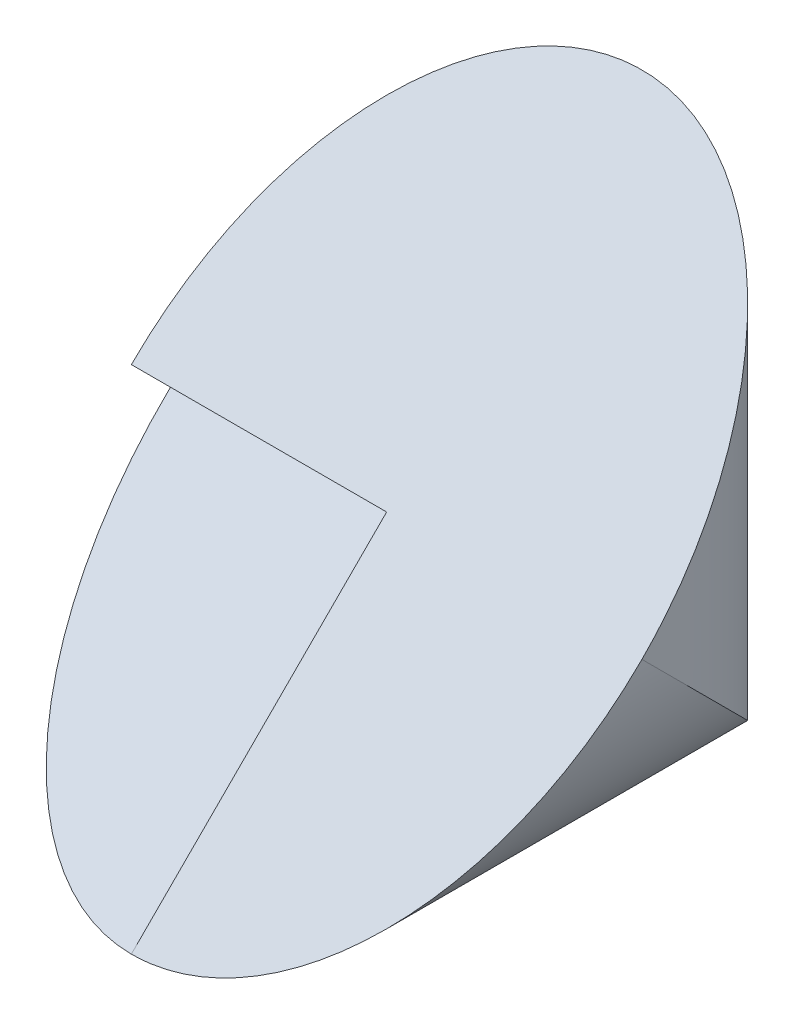
ISO-10303-21;
HEADER;
FILE_DESCRIPTION(('STEP AP214'),'2;1');
FILE_NAME('part.step','',(''),(''),'','','');
FILE_SCHEMA(('AUTOMOTIVE_DESIGN { 1 0 10303 214 1 1 1 1 }'));
ENDSEC;
DATA;
#1=APPLICATION_CONTEXT('core data for automotive mechanical design processes');
#2=APPLICATION_PROTOCOL_DEFINITION('international standard','automotive_design',2000,#1);
#3=PRODUCT_CONTEXT('',#1,'mechanical');
#4=PRODUCT('Part','Part','',(#3));
#5=PRODUCT_RELATED_PRODUCT_CATEGORY('part','',(#4));
#6=PRODUCT_DEFINITION_FORMATION('','',#4);
#7=PRODUCT_DEFINITION_CONTEXT('part definition',#1,'design');
#8=PRODUCT_DEFINITION('design','',#6,#7);
#9=PRODUCT_DEFINITION_SHAPE('','',#8);
#10=(LENGTH_UNIT() NAMED_UNIT(*) SI_UNIT(.MILLI.,.METRE.));
#11=(NAMED_UNIT(*) PLANE_ANGLE_UNIT() SI_UNIT($,.RADIAN.));
#12=(NAMED_UNIT(*) SI_UNIT($,.STERADIAN.) SOLID_ANGLE_UNIT());
#13=UNCERTAINTY_MEASURE_WITH_UNIT(LENGTH_MEASURE(1.E-05),#10,'distance_accuracy_value','');
#14=(GEOMETRIC_REPRESENTATION_CONTEXT(3) GLOBAL_UNCERTAINTY_ASSIGNED_CONTEXT((#13)) GLOBAL_UNIT_ASSIGNED_CONTEXT((#10,
#11,#12)) REPRESENTATION_CONTEXT('',''));
#15=CARTESIAN_POINT('',(0.,0.,0.));
#16=DIRECTION('',(0.,0.,1.));
#17=DIRECTION('',(1.,0.,0.));
#18=AXIS2_PLACEMENT_3D('',#15,#16,#17);
#19=CARTESIAN_POINT('',(0.,0.,60.));
#20=DIRECTION('',(0.,0.,-1.));
#21=DIRECTION('',(-1.,0.,0.));
#22=AXIS2_PLACEMENT_3D('',#19,#20,#21);
#23=CYLINDRICAL_SURFACE('',#22,30.);
#24=CARTESIAN_POINT('',(0.,0.,30.));
#25=DIRECTION('',(0.,-0.707106781186547,-0.707106781186547));
#26=DIRECTION('',(0.,0.707106781186547,-0.707106781186547));
#27=AXIS2_PLACEMENT_3D('',#24,#25,#26);
#28=ELLIPSE('',#27,42.4264068711928,30.);
#29=CARTESIAN_POINT('',(0.,-30.,60.));
#30=VERTEX_POINT('',#29);
#31=CARTESIAN_POINT('',(30.,0.,30.));
#32=VERTEX_POINT('',#31);
#33=EDGE_CURVE('E166',#30,#32,#28,.F.);
#34=ORIENTED_EDGE('',*,*,#33,.F.);
#35=CARTESIAN_POINT('',(0.,0.,20.));
#36=DIRECTION('',(0.,-0.8,-0.6));
#37=DIRECTION('',(0.,0.6,-0.8));
#38=AXIS2_PLACEMENT_3D('',#35,#36,#37);
#39=ELLIPSE('',#38,50.,30.);
#40=CARTESIAN_POINT('',(-29.6922995583236,-4.28571428571428,25.7142857142857));
#41=VERTEX_POINT('',#40);
#42=EDGE_CURVE('E155',#30,#41,#39,.T.);
#43=ORIENTED_EDGE('',*,*,#42,.T.);
#44=CARTESIAN_POINT('',(0.,0.,30.));
#45=DIRECTION('',(0.,0.707106781186547,-0.707106781186547));
#46=DIRECTION('',(0.,-0.707106781186547,-0.707106781186547));
#47=AXIS2_PLACEMENT_3D('',#44,#45,#46);
#48=ELLIPSE('',#47,42.4264068711928,30.);
#49=EDGE_CURVE('E127',#41,#32,#48,.F.);
#50=ORIENTED_EDGE('',*,*,#49,.T.);
#51=EDGE_LOOP('',(#34,#43,#50));
#52=FACE_BOUND('',#51,.T.);
#53=ADVANCED_FACE('F105',(#52),#23,.T.);
#54=CARTESIAN_POINT('',(0.,60.,30.));
#55=DIRECTION('',(0.,-1.,0.));
#56=DIRECTION('',(0.,0.,-1.));
#57=AXIS2_PLACEMENT_3D('',#54,#55,#56);
#58=CYLINDRICAL_SURFACE('',#57,30.);
#59=CARTESIAN_POINT('',(0.,-7.49999999999999,30.));
#60=DIRECTION('',(0.,-0.8,-0.6));
#61=DIRECTION('',(0.,-0.6,0.8));
#62=AXIS2_PLACEMENT_3D('',#59,#60,#61);
#63=ELLIPSE('',#62,37.5,30.);
#64=CARTESIAN_POINT('',(-28.2842712474619,0.,20.));
#65=VERTEX_POINT('',#64);
#66=EDGE_CURVE('E152',#41,#65,#63,.T.);
#67=ORIENTED_EDGE('',*,*,#66,.T.);
#68=CARTESIAN_POINT('',(0.,0.,30.));
#69=DIRECTION('',(0.,1.,0.));
#70=DIRECTION('',(0.,0.,1.));
#71=AXIS2_PLACEMENT_3D('',#68,#69,#70);
#72=CIRCLE('',#71,30.);
#73=CARTESIAN_POINT('',(-30.,0.,30.));
#74=VERTEX_POINT('',#73);
#75=EDGE_CURVE('E149',#65,#74,#72,.T.);
#76=ORIENTED_EDGE('',*,*,#75,.T.);
#77=CARTESIAN_POINT('',(0.,0.,30.));
#78=DIRECTION('',(0.,-0.707106781186547,-0.707106781186547));
#79=DIRECTION('',(0.,0.707106781186547,-0.707106781186547));
#80=AXIS2_PLACEMENT_3D('',#77,#78,#79);
#81=ELLIPSE('',#80,42.4264068711928,30.);
#82=EDGE_CURVE('E112',#32,#74,#81,.F.);
#83=ORIENTED_EDGE('',*,*,#82,.F.);
#84=ORIENTED_EDGE('',*,*,#49,.F.);
#85=EDGE_LOOP('',(#67,#76,#83,#84));
#86=FACE_BOUND('',#85,.T.);
#87=ADVANCED_FACE('F173',(#86),#58,.T.);
#88=CARTESIAN_POINT('',(30.,15.,15.));
#89=DIRECTION('',(0.,0.707106781186547,0.707106781186548));
#90=DIRECTION('',(0.,-0.707106781186548,0.707106781186547));
#91=AXIS2_PLACEMENT_3D('',#88,#89,#90);
#92=PLANE('',#91);
#93=DIRECTION('',(-1.,0.,0.));
#94=VECTOR('',#93,1.);
#95=CARTESIAN_POINT('',(30.,0.,30.));
#96=LINE('',#95,#94);
#97=CARTESIAN_POINT('',(0.,0.,30.));
#98=VERTEX_POINT('',#97);
#99=EDGE_CURVE('E12',#98,#74,#96,.T.);
#100=ORIENTED_EDGE('',*,*,#99,.F.);
#101=DIRECTION('',(0.,-0.707106781186548,0.707106781186547));
#102=VECTOR('',#101,1.);
#103=CARTESIAN_POINT('',(0.,-30.,60.));
#104=LINE('',#103,#102);
#105=EDGE_CURVE('E157',#98,#30,#104,.T.);
#106=ORIENTED_EDGE('',*,*,#105,.T.);
#107=ORIENTED_EDGE('',*,*,#33,.T.);
#108=ORIENTED_EDGE('',*,*,#82,.T.);
#109=EDGE_LOOP('',(#100,#106,#107,#108));
#110=FACE_BOUND('',#109,.T.);
#111=ADVANCED_FACE('F171',(#110),#92,.T.);
#112=CARTESIAN_POINT('',(-60.,0.,30.));
#113=DIRECTION('',(0.,1.,0.));
#114=DIRECTION('',(0.,0.,1.));
#115=AXIS2_PLACEMENT_3D('',#112,#113,#114);
#116=PLANE('',#115);
#117=DIRECTION('',(1.,0.,0.));
#118=VECTOR('',#117,1.);
#119=CARTESIAN_POINT('',(-60.,0.,20.));
#120=LINE('',#119,#118);
#121=CARTESIAN_POINT('',(0.,0.,20.));
#122=VERTEX_POINT('',#121);
#123=EDGE_CURVE('E144',#65,#122,#120,.T.);
#124=ORIENTED_EDGE('',*,*,#123,.T.);
#125=DIRECTION('',(0.,0.,1.));
#126=VECTOR('',#125,1.);
#127=CARTESIAN_POINT('',(0.,0.,30.));
#128=LINE('',#127,#126);
#129=EDGE_CURVE('E146',#122,#98,#128,.T.);
#130=ORIENTED_EDGE('',*,*,#129,.T.);
#131=ORIENTED_EDGE('',*,*,#99,.T.);
#132=ORIENTED_EDGE('',*,*,#75,.F.);
#133=EDGE_LOOP('',(#124,#130,#131,#132));
#134=FACE_BOUND('',#133,.T.);
#135=ADVANCED_FACE('F145',(#134),#116,.F.);
#136=CARTESIAN_POINT('',(-60.,0.,20.));
#137=DIRECTION('',(0.,-0.8,-0.6));
#138=DIRECTION('',(0.,0.6,-0.8));
#139=AXIS2_PLACEMENT_3D('',#136,#137,#138);
#140=PLANE('',#139);
#141=DIRECTION('',(0.,0.6,-0.8));
#142=VECTOR('',#141,1.);
#143=CARTESIAN_POINT('',(0.,0.,20.));
#144=LINE('',#143,#142);
#145=EDGE_CURVE('E119',#30,#122,#144,.T.);
#146=ORIENTED_EDGE('',*,*,#145,.T.);
#147=ORIENTED_EDGE('',*,*,#123,.F.);
#148=ORIENTED_EDGE('',*,*,#66,.F.);
#149=ORIENTED_EDGE('',*,*,#42,.F.);
#150=EDGE_LOOP('',(#146,#147,#148,#149));
#151=FACE_BOUND('',#150,.T.);
#152=ADVANCED_FACE('F154',(#151),#140,.F.);
#153=CARTESIAN_POINT('',(0.,0.,0.));
#154=DIRECTION('',(-1.,0.,0.));
#155=DIRECTION('',(0.,0.,1.));
#156=AXIS2_PLACEMENT_3D('',#153,#154,#155);
#157=PLANE('',#156);
#158=ORIENTED_EDGE('',*,*,#105,.F.);
#159=ORIENTED_EDGE('',*,*,#129,.F.);
#160=ORIENTED_EDGE('',*,*,#145,.F.);
#161=EDGE_LOOP('',(#158,#159,#160));
#162=FACE_BOUND('',#161,.T.);
#163=ADVANCED_FACE('F159',(#162),#157,.T.);
#164=CLOSED_SHELL('',(#53,#87,#111,#135,#152,#163));
#165=MANIFOLD_SOLID_BREP('B2',#164);
#166=ADVANCED_BREP_SHAPE_REPRESENTATION('',(#18,#165),#14);
#167=SHAPE_DEFINITION_REPRESENTATION(#9,#166);
ENDSEC;
END-ISO-10303-21;
